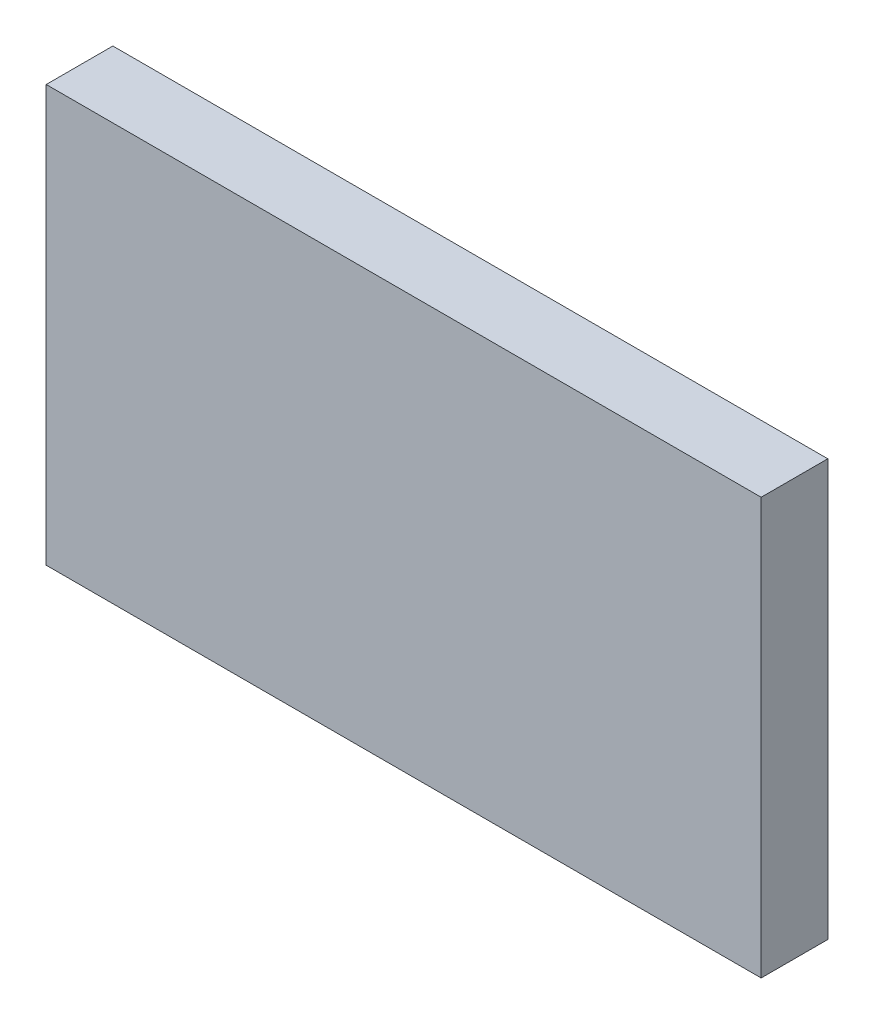
ISO-10303-21;
HEADER;
FILE_DESCRIPTION(('STEP AP214'),'2;1');
FILE_NAME('part.step','',(''),(''),'','','');
FILE_SCHEMA(('AUTOMOTIVE_DESIGN { 1 0 10303 214 1 1 1 1 }'));
ENDSEC;
DATA;
#1=APPLICATION_CONTEXT('core data for automotive mechanical design processes');
#2=APPLICATION_PROTOCOL_DEFINITION('international standard','automotive_design',2000,#1);
#3=PRODUCT_CONTEXT('',#1,'mechanical');
#4=PRODUCT('Part','Part','',(#3));
#5=PRODUCT_RELATED_PRODUCT_CATEGORY('part','',(#4));
#6=PRODUCT_DEFINITION_FORMATION('','',#4);
#7=PRODUCT_DEFINITION_CONTEXT('part definition',#1,'design');
#8=PRODUCT_DEFINITION('design','',#6,#7);
#9=PRODUCT_DEFINITION_SHAPE('','',#8);
#10=(LENGTH_UNIT() NAMED_UNIT(*) SI_UNIT(.MILLI.,.METRE.));
#11=(NAMED_UNIT(*) PLANE_ANGLE_UNIT() SI_UNIT($,.RADIAN.));
#12=(NAMED_UNIT(*) SI_UNIT($,.STERADIAN.) SOLID_ANGLE_UNIT());
#13=UNCERTAINTY_MEASURE_WITH_UNIT(LENGTH_MEASURE(1.E-05),#10,'distance_accuracy_value','');
#14=(GEOMETRIC_REPRESENTATION_CONTEXT(3) GLOBAL_UNCERTAINTY_ASSIGNED_CONTEXT((#13)) GLOBAL_UNIT_ASSIGNED_CONTEXT((#10,
#11,#12)) REPRESENTATION_CONTEXT('',''));
#15=CARTESIAN_POINT('',(0.,0.,0.));
#16=DIRECTION('',(0.,0.,1.));
#17=DIRECTION('',(1.,0.,0.));
#18=AXIS2_PLACEMENT_3D('',#15,#16,#17);
#19=CARTESIAN_POINT('',(-53.639751552795,31.2372670807453,10.));
#20=DIRECTION('',(1.,0.,0.));
#21=DIRECTION('',(0.,0.,-1.));
#22=AXIS2_PLACEMENT_3D('',#19,#20,#21);
#23=PLANE('',#22);
#24=DIRECTION('',(0.,-1.,0.));
#25=VECTOR('',#24,1.);
#26=CARTESIAN_POINT('',(-53.639751552795,31.2372670807453,0.));
#27=LINE('',#26,#25);
#28=CARTESIAN_POINT('',(-53.639751552795,31.2372670807453,0.));
#29=VERTEX_POINT('',#28);
#30=CARTESIAN_POINT('',(-53.639751552795,-31.2372670807453,0.));
#31=VERTEX_POINT('',#30);
#32=EDGE_CURVE('E98',#29,#31,#27,.T.);
#33=ORIENTED_EDGE('',*,*,#32,.T.);
#34=DIRECTION('',(0.,0.,-1.));
#35=VECTOR('',#34,1.);
#36=CARTESIAN_POINT('',(-53.639751552795,-31.2372670807453,10.));
#37=LINE('',#36,#35);
#38=CARTESIAN_POINT('',(-53.639751552795,-31.2372670807453,10.));
#39=VERTEX_POINT('',#38);
#40=EDGE_CURVE('E11',#39,#31,#37,.T.);
#41=ORIENTED_EDGE('',*,*,#40,.F.);
#42=DIRECTION('',(0.,-1.,0.));
#43=VECTOR('',#42,1.);
#44=CARTESIAN_POINT('',(-53.639751552795,31.2372670807453,10.));
#45=LINE('',#44,#43);
#46=CARTESIAN_POINT('',(-53.639751552795,31.2372670807453,10.));
#47=VERTEX_POINT('',#46);
#48=EDGE_CURVE('E86',#47,#39,#45,.T.);
#49=ORIENTED_EDGE('',*,*,#48,.F.);
#50=DIRECTION('',(0.,0.,-1.));
#51=VECTOR('',#50,1.);
#52=CARTESIAN_POINT('',(-53.639751552795,31.2372670807453,10.));
#53=LINE('',#52,#51);
#54=EDGE_CURVE('E94',#47,#29,#53,.T.);
#55=ORIENTED_EDGE('',*,*,#54,.T.);
#56=EDGE_LOOP('',(#33,#41,#49,#55));
#57=FACE_BOUND('',#56,.T.);
#58=ADVANCED_FACE('F35',(#57),#23,.F.);
#59=CARTESIAN_POINT('',(53.639751552795,-31.2372670807453,10.));
#60=DIRECTION('',(0.,1.,0.));
#61=DIRECTION('',(0.,0.,1.));
#62=AXIS2_PLACEMENT_3D('',#59,#60,#61);
#63=PLANE('',#62);
#64=DIRECTION('',(1.,0.,0.));
#65=VECTOR('',#64,1.);
#66=CARTESIAN_POINT('',(53.639751552795,-31.2372670807453,0.));
#67=LINE('',#66,#65);
#68=CARTESIAN_POINT('',(53.639751552795,-31.2372670807453,0.));
#69=VERTEX_POINT('',#68);
#70=EDGE_CURVE('E90',#31,#69,#67,.T.);
#71=ORIENTED_EDGE('',*,*,#70,.T.);
#72=DIRECTION('',(0.,0.,-1.));
#73=VECTOR('',#72,1.);
#74=CARTESIAN_POINT('',(53.639751552795,-31.2372670807453,10.));
#75=LINE('',#74,#73);
#76=CARTESIAN_POINT('',(53.639751552795,-31.2372670807453,10.));
#77=VERTEX_POINT('',#76);
#78=EDGE_CURVE('E43',#77,#69,#75,.T.);
#79=ORIENTED_EDGE('',*,*,#78,.F.);
#80=DIRECTION('',(1.,0.,0.));
#81=VECTOR('',#80,1.);
#82=CARTESIAN_POINT('',(53.639751552795,-31.2372670807453,10.));
#83=LINE('',#82,#81);
#84=EDGE_CURVE('E81',#39,#77,#83,.T.);
#85=ORIENTED_EDGE('',*,*,#84,.F.);
#86=ORIENTED_EDGE('',*,*,#40,.T.);
#87=EDGE_LOOP('',(#71,#79,#85,#86));
#88=FACE_BOUND('',#87,.T.);
#89=ADVANCED_FACE('F89',(#88),#63,.F.);
#90=CARTESIAN_POINT('',(53.639751552795,31.2372670807453,10.));
#91=DIRECTION('',(-1.,0.,0.));
#92=DIRECTION('',(0.,0.,1.));
#93=AXIS2_PLACEMENT_3D('',#90,#91,#92);
#94=PLANE('',#93);
#95=DIRECTION('',(0.,1.,0.));
#96=VECTOR('',#95,1.);
#97=CARTESIAN_POINT('',(53.639751552795,31.2372670807453,0.));
#98=LINE('',#97,#96);
#99=CARTESIAN_POINT('',(53.639751552795,31.2372670807453,0.));
#100=VERTEX_POINT('',#99);
#101=EDGE_CURVE('E68',#69,#100,#98,.T.);
#102=ORIENTED_EDGE('',*,*,#101,.T.);
#103=DIRECTION('',(0.,0.,-1.));
#104=VECTOR('',#103,1.);
#105=CARTESIAN_POINT('',(53.639751552795,31.2372670807453,10.));
#106=LINE('',#105,#104);
#107=CARTESIAN_POINT('',(53.639751552795,31.2372670807453,10.));
#108=VERTEX_POINT('',#107);
#109=EDGE_CURVE('E91',#108,#100,#106,.T.);
#110=ORIENTED_EDGE('',*,*,#109,.F.);
#111=DIRECTION('',(0.,1.,0.));
#112=VECTOR('',#111,1.);
#113=CARTESIAN_POINT('',(53.639751552795,31.2372670807453,10.));
#114=LINE('',#113,#112);
#115=EDGE_CURVE('E84',#77,#108,#114,.T.);
#116=ORIENTED_EDGE('',*,*,#115,.F.);
#117=ORIENTED_EDGE('',*,*,#78,.T.);
#118=EDGE_LOOP('',(#102,#110,#116,#117));
#119=FACE_BOUND('',#118,.T.);
#120=ADVANCED_FACE('F92',(#119),#94,.F.);
#121=CARTESIAN_POINT('',(53.639751552795,31.2372670807453,10.));
#122=DIRECTION('',(0.,-1.,0.));
#123=DIRECTION('',(0.,0.,-1.));
#124=AXIS2_PLACEMENT_3D('',#121,#122,#123);
#125=PLANE('',#124);
#126=DIRECTION('',(-1.,0.,0.));
#127=VECTOR('',#126,1.);
#128=CARTESIAN_POINT('',(53.639751552795,31.2372670807453,0.));
#129=LINE('',#128,#127);
#130=EDGE_CURVE('E74',#100,#29,#129,.T.);
#131=ORIENTED_EDGE('',*,*,#130,.T.);
#132=ORIENTED_EDGE('',*,*,#54,.F.);
#133=DIRECTION('',(-1.,0.,0.));
#134=VECTOR('',#133,1.);
#135=CARTESIAN_POINT('',(53.639751552795,31.2372670807453,10.));
#136=LINE('',#135,#134);
#137=EDGE_CURVE('E51',#108,#47,#136,.T.);
#138=ORIENTED_EDGE('',*,*,#137,.F.);
#139=ORIENTED_EDGE('',*,*,#109,.T.);
#140=EDGE_LOOP('',(#131,#132,#138,#139));
#141=FACE_BOUND('',#140,.T.);
#142=ADVANCED_FACE('F105',(#141),#125,.F.);
#143=CARTESIAN_POINT('',(0.,0.,10.));
#144=DIRECTION('',(0.,0.,-1.));
#145=DIRECTION('',(-1.,0.,0.));
#146=AXIS2_PLACEMENT_3D('',#143,#144,#145);
#147=PLANE('',#146);
#148=ORIENTED_EDGE('',*,*,#48,.T.);
#149=ORIENTED_EDGE('',*,*,#84,.T.);
#150=ORIENTED_EDGE('',*,*,#115,.T.);
#151=ORIENTED_EDGE('',*,*,#137,.T.);
#152=EDGE_LOOP('',(#148,#149,#150,#151));
#153=FACE_BOUND('',#152,.T.);
#154=ADVANCED_FACE('F82',(#153),#147,.F.);
#155=CARTESIAN_POINT('',(0.,0.,0.));
#156=DIRECTION('',(0.,0.,-1.));
#157=DIRECTION('',(-1.,0.,0.));
#158=AXIS2_PLACEMENT_3D('',#155,#156,#157);
#159=PLANE('',#158);
#160=ORIENTED_EDGE('',*,*,#32,.F.);
#161=ORIENTED_EDGE('',*,*,#130,.F.);
#162=ORIENTED_EDGE('',*,*,#101,.F.);
#163=ORIENTED_EDGE('',*,*,#70,.F.);
#164=EDGE_LOOP('',(#160,#161,#162,#163));
#165=FACE_BOUND('',#164,.T.);
#166=ADVANCED_FACE('F108',(#165),#159,.T.);
#167=CLOSED_SHELL('',(#58,#89,#120,#142,#154,#166));
#168=MANIFOLD_SOLID_BREP('B2',#167);
#169=ADVANCED_BREP_SHAPE_REPRESENTATION('',(#18,#168),#14);
#170=SHAPE_DEFINITION_REPRESENTATION(#9,#169);
ENDSEC;
END-ISO-10303-21;
